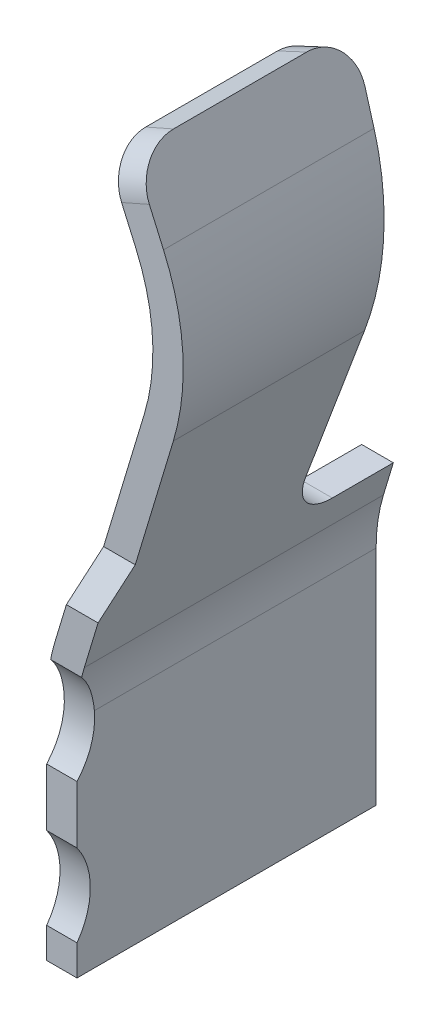
ISO-10303-21;
HEADER;
FILE_DESCRIPTION(('STEP AP214'),'2;1');
FILE_NAME('part.step','',(''),(''),'','','');
FILE_SCHEMA(('AUTOMOTIVE_DESIGN { 1 0 10303 214 1 1 1 1 }'));
ENDSEC;
DATA;
#1=APPLICATION_CONTEXT('core data for automotive mechanical design processes');
#2=APPLICATION_PROTOCOL_DEFINITION('international standard','automotive_design',2000,#1);
#3=PRODUCT_CONTEXT('',#1,'mechanical');
#4=PRODUCT('Part','Part','',(#3));
#5=PRODUCT_RELATED_PRODUCT_CATEGORY('part','',(#4));
#6=PRODUCT_DEFINITION_FORMATION('','',#4);
#7=PRODUCT_DEFINITION_CONTEXT('part definition',#1,'design');
#8=PRODUCT_DEFINITION('design','',#6,#7);
#9=PRODUCT_DEFINITION_SHAPE('','',#8);
#10=(LENGTH_UNIT() NAMED_UNIT(*) SI_UNIT(.MILLI.,.METRE.));
#11=(NAMED_UNIT(*) PLANE_ANGLE_UNIT() SI_UNIT($,.RADIAN.));
#12=(NAMED_UNIT(*) SI_UNIT($,.STERADIAN.) SOLID_ANGLE_UNIT());
#13=UNCERTAINTY_MEASURE_WITH_UNIT(LENGTH_MEASURE(1.E-05),#10,'distance_accuracy_value','');
#14=(GEOMETRIC_REPRESENTATION_CONTEXT(3) GLOBAL_UNCERTAINTY_ASSIGNED_CONTEXT((#13)) GLOBAL_UNIT_ASSIGNED_CONTEXT((#10,
#11,#12)) REPRESENTATION_CONTEXT('',''));
#15=CARTESIAN_POINT('',(0.,0.,0.));
#16=DIRECTION('',(0.,0.,1.));
#17=DIRECTION('',(1.,0.,0.));
#18=AXIS2_PLACEMENT_3D('',#15,#16,#17);
#19=CARTESIAN_POINT('',(0.683862741329986,3.53312166947706,-0.236832722369338));
#20=DIRECTION('',(-0.914255270392898,-0.402239697454473,0.0483789866630426));
#21=DIRECTION('',(0.402711251685503,-0.915327071470027,0.));
#22=AXIS2_PLACEMENT_3D('',#19,#20,#21);
#23=CYLINDRICAL_SURFACE('',#22,0.2);
#24=CARTESIAN_POINT('',(0.670358522674722,3.50329761180303,-0.434687053017797));
#25=CARTESIAN_POINT('',(0.619281595528135,3.6193909515076,-0.448650066039084));
#26=CARTESIAN_POINT('',(0.581012816481815,3.70637250294574,-0.363398989614743));
#27=CARTESIAN_POINT('',(0.581012816481815,3.70637250294574,-0.235652283248446));
#28=(BOUNDED_CURVE() B_SPLINE_CURVE(3,(#24,#25,#26,#27),.UNSPECIFIED.,.F.,
.F.) B_SPLINE_CURVE_WITH_KNOTS((4,4),(3.0320715031167,4.71238898038462),
.UNSPECIFIED.) CURVE() GEOMETRIC_REPRESENTATION_ITEM() RATIONAL_B_SPLINE_CURVE((1.,
0.778229742533871,0.778229742533871,1.)) REPRESENTATION_ITEM(''));
#29=CARTESIAN_POINT('',(0.670358522674722,3.50329761180303,-0.434687053017797));
#30=VERTEX_POINT('',#29);
#31=CARTESIAN_POINT('',(0.581012816481815,3.70637250294574,-0.235652283248446));
#32=VERTEX_POINT('',#31);
#33=EDGE_CURVE('E364',#30,#32,#28,.T.);
#34=ORIENTED_EDGE('',*,*,#33,.F.);
#35=DIRECTION('',(0.914255270392898,0.402239697454473,-0.0483789866630426));
#36=VECTOR('',#35,1.);
#37=CARTESIAN_POINT('',(-23.377177596038,-7.07676024092296,0.837819069551529));
#38=LINE('',#37,#36);
#39=CARTESIAN_POINT('',(0.533059461954222,3.44289092405021,-0.427421697659669));
#40=VERTEX_POINT('',#39);
#41=EDGE_CURVE('E11',#40,#30,#38,.T.);
#42=ORIENTED_EDGE('',*,*,#41,.F.);
#43=CARTESIAN_POINT('',(0.443713755761313,3.64596581519291,-0.228386927890318));
#44=CARTESIAN_POINT('',(0.443713755761312,3.64596581519291,-0.356133634256615));
#45=CARTESIAN_POINT('',(0.481982534807633,3.55898426375477,-0.441384710680957));
#46=CARTESIAN_POINT('',(0.533059461954222,3.44289092405021,-0.427421697659669));
#47=(BOUNDED_CURVE() B_SPLINE_CURVE(3,(#43,#44,#45,#46),.UNSPECIFIED.,.F.,
.F.) B_SPLINE_CURVE_WITH_KNOTS((4,4),(1.57079632679495,3.25111380406287),
.UNSPECIFIED.) CURVE() GEOMETRIC_REPRESENTATION_ITEM() RATIONAL_B_SPLINE_CURVE((1.,
0.77822974253387,0.77822974253387,1.)) REPRESENTATION_ITEM(''));
#48=CARTESIAN_POINT('',(0.443713755761313,3.64596581519291,-0.228386927890318));
#49=VERTEX_POINT('',#48);
#50=EDGE_CURVE('E559',#49,#40,#47,.T.);
#51=ORIENTED_EDGE('',*,*,#50,.F.);
#52=DIRECTION('',(-0.914255270392898,-0.402239697454473,0.0483789866630426));
#53=VECTOR('',#52,1.);
#54=CARTESIAN_POINT('',(0.603320490992884,3.71618708377106,-0.236832722369339));
#55=LINE('',#54,#53);
#56=EDGE_CURVE('E541',#32,#49,#55,.T.);
#57=ORIENTED_EDGE('',*,*,#56,.F.);
#58=EDGE_LOOP('',(#34,#42,#51,#57));
#59=FACE_BOUND('',#58,.T.);
#60=ADVANCED_FACE('F16',(#59),#23,.T.);
#61=CARTESIAN_POINT('',(0.661555066818914,3.52330708865174,0.423604352914838));
#62=DIRECTION('',(0.915327071470027,0.402711251685503,0.));
#63=DIRECTION('',(-0.402711251685503,0.915327071470027,0.));
#64=AXIS2_PLACEMENT_3D('',#61,#62,#63);
#65=CYLINDRICAL_SURFACE('',#64,0.2);
#66=CARTESIAN_POINT('',(0.524256006098412,3.46290040089891,0.423604352914837));
#67=DIRECTION('',(-0.915327071470028,-0.402711251685501,0.));
#68=DIRECTION('',(-0.402711251685501,0.915327071470028,0.));
#69=AXIS2_PLACEMENT_3D('',#66,#67,#68);
#70=CIRCLE('',#69,0.2);
#71=CARTESIAN_POINT('',(0.524256006098411,3.46290040089891,0.623604352914837));
#72=VERTEX_POINT('',#71);
#73=CARTESIAN_POINT('',(0.443713755761312,3.64596581519291,0.423604352914837));
#74=VERTEX_POINT('',#73);
#75=EDGE_CURVE('E556',#72,#74,#70,.T.);
#76=ORIENTED_EDGE('',*,*,#75,.F.);
#77=DIRECTION('',(-0.915327071470027,-0.402711251685503,0.));
#78=VECTOR('',#77,1.);
#79=CARTESIAN_POINT('',(-24.0930633966531,-7.36784176638169,0.623604352914803));
#80=LINE('',#79,#78);
#81=CARTESIAN_POINT('',(0.661555066818913,3.52330708865174,0.623604352914837));
#82=VERTEX_POINT('',#81);
#83=EDGE_CURVE('E27',#82,#72,#80,.T.);
#84=ORIENTED_EDGE('',*,*,#83,.F.);
#85=CARTESIAN_POINT('',(0.661555066818913,3.52330708865174,0.423604352914838));
#86=DIRECTION('',(0.915327071470028,0.4027112516855,0.));
#87=DIRECTION('',(0.4027112516855,-0.915327071470028,0.));
#88=AXIS2_PLACEMENT_3D('',#85,#86,#87);
#89=CIRCLE('',#88,0.2);
#90=CARTESIAN_POINT('',(0.581012816481813,3.70637250294574,0.423604352914837));
#91=VERTEX_POINT('',#90);
#92=EDGE_CURVE('E349',#91,#82,#89,.T.);
#93=ORIENTED_EDGE('',*,*,#92,.F.);
#94=DIRECTION('',(0.915327071470027,0.402711251685503,0.));
#95=VECTOR('',#94,1.);
#96=CARTESIAN_POINT('',(0.581012816481813,3.70637250294574,0.423604352914837));
#97=LINE('',#96,#95);
#98=EDGE_CURVE('E363',#74,#91,#97,.T.);
#99=ORIENTED_EDGE('',*,*,#98,.F.);
#100=EDGE_LOOP('',(#76,#84,#93,#99));
#101=FACE_BOUND('',#100,.T.);
#102=ADVANCED_FACE('F419',(#101),#65,.T.);
#103=CARTESIAN_POINT('',(-28.19,1.65634067151207,-0.212546111318104));
#104=DIRECTION('',(0.,-1.,0.));
#105=DIRECTION('',(0.,0.,-1.));
#106=AXIS2_PLACEMENT_3D('',#103,#104,#105);
#107=PLANE('',#106);
#108=DIRECTION('',(0.,0.,-1.));
#109=VECTOR('',#108,1.);
#110=CARTESIAN_POINT('',(0.34849659089442,1.65634067151207,-0.740000000000021));
#111=LINE('',#110,#109);
#112=CARTESIAN_POINT('',(0.34849659089442,1.65634067151207,-0.438042305987955));
#113=VERTEX_POINT('',#112);
#114=CARTESIAN_POINT('',(0.34849659089442,1.65634067151207,-0.740000000000021));
#115=VERTEX_POINT('',#114);
#116=EDGE_CURVE('E268',#113,#115,#111,.T.);
#117=ORIENTED_EDGE('',*,*,#116,.F.);
#118=DIRECTION('',(1.,0.,0.));
#119=VECTOR('',#118,1.);
#120=CARTESIAN_POINT('',(0.505164921058449,1.65634067151207,-0.438042305987954));
#121=LINE('',#120,#119);
#122=CARTESIAN_POINT('',(0.505164921058459,1.65634067151207,-0.438042305987954));
#123=VERTEX_POINT('',#122);
#124=EDGE_CURVE('E308',#113,#123,#121,.T.);
#125=ORIENTED_EDGE('',*,*,#124,.T.);
#126=DIRECTION('',(0.,0.,1.));
#127=VECTOR('',#126,1.);
#128=CARTESIAN_POINT('',(0.505164921058459,1.65634067151207,-0.74000000000002));
#129=LINE('',#128,#127);
#130=CARTESIAN_POINT('',(0.505164921058459,1.65634067151207,-0.74000000000002));
#131=VERTEX_POINT('',#130);
#132=EDGE_CURVE('E270',#131,#123,#129,.T.);
#133=ORIENTED_EDGE('',*,*,#132,.F.);
#134=DIRECTION('',(-1.,0.,0.));
#135=VECTOR('',#134,1.);
#136=CARTESIAN_POINT('',(1.27,1.65634067151207,-0.740000000000019));
#137=LINE('',#136,#135);
#138=EDGE_CURVE('E263',#131,#115,#137,.T.);
#139=ORIENTED_EDGE('',*,*,#138,.T.);
#140=EDGE_LOOP('',(#117,#125,#133,#139));
#141=FACE_BOUND('',#140,.T.);
#142=ADVANCED_FACE('F265',(#141),#107,.F.);
#143=CARTESIAN_POINT('',(-28.19,3.70637250294571,-0.459111687165995));
#144=DIRECTION('',(0.,0.119413416546905,0.992844618230162));
#145=DIRECTION('',(1.,0.,0.));
#146=AXIS2_PLACEMENT_3D('',#143,#144,#145);
#147=PLANE('',#146);
#148=DIRECTION('',(0.286748539926818,0.951150986717315,-0.11439875574724));
#149=VECTOR('',#148,1.);
#150=CARTESIAN_POINT('',(0.474122364888059,1.55337185451571,-0.200161637444148));
#151=LINE('',#150,#149);
#152=CARTESIAN_POINT('',(0.57266002273041,1.88022335482146,-0.239473382341922));
#153=VERTEX_POINT('',#152);
#154=CARTESIAN_POINT('',(0.780201760453783,2.56864369924933,-0.322272466749581));
#155=VERTEX_POINT('',#154);
#156=EDGE_CURVE('E547',#153,#155,#151,.T.);
#157=ORIENTED_EDGE('',*,*,#156,.F.);
#158=DIRECTION('',(-1.,0.,0.));
#159=VECTOR('',#158,1.);
#160=CARTESIAN_POINT('',(0.348496590894408,1.88022335482146,-0.239473382341922));
#161=LINE('',#160,#159);
#162=CARTESIAN_POINT('',(0.415991692566373,1.88022335482146,-0.239473382341922));
#163=VERTEX_POINT('',#162);
#164=EDGE_CURVE('E322',#153,#163,#161,.T.);
#165=ORIENTED_EDGE('',*,*,#164,.T.);
#166=DIRECTION('',(-0.28674853992682,-0.951150986717314,0.11439875574724));
#167=VECTOR('',#166,1.);
#168=CARTESIAN_POINT('',(0.330336045111495,1.59610175610151,-0.205300934614505));
#169=LINE('',#168,#167);
#170=CARTESIAN_POINT('',(0.63658626409634,2.61194022573825,-0.327479914176623));
#171=VERTEX_POINT('',#170);
#172=EDGE_CURVE('E289',#171,#163,#169,.T.);
#173=ORIENTED_EDGE('',*,*,#172,.F.);
#174=CARTESIAN_POINT('',(0.594476693183414,3.30329498734983,-0.410631932744419));
#175=CARTESIAN_POINT('',(0.691454989707599,3.08287189317973,-0.384120760424612));
#176=CARTESIAN_POINT('',(0.706095511176566,2.84250387207174,-0.355210731501567));
#177=CARTESIAN_POINT('',(0.63658626409634,2.61194022573825,-0.327479914176623));
#178=(BOUNDED_CURVE() B_SPLINE_CURVE(3,(#174,#175,#176,#177),.UNSPECIFIED.,.F.,
.F.) B_SPLINE_CURVE_WITH_KNOTS((4,4),(4.29791199977039,5.00519872138853),
.UNSPECIFIED.) CURVE() GEOMETRIC_REPRESENTATION_ITEM() RATIONAL_B_SPLINE_CURVE((1.,
0.958744787021091,0.958744787021091,1.)) REPRESENTATION_ITEM(''));
#179=CARTESIAN_POINT('',(0.594476693183414,3.30329498734983,-0.410631932744419));
#180=VERTEX_POINT('',#179);
#181=EDGE_CURVE('E568',#180,#171,#178,.T.);
#182=ORIENTED_EDGE('',*,*,#181,.F.);
#183=DIRECTION('',(0.400292818236851,-0.909830186054405,0.109428936813833));
#184=VECTOR('',#183,1.);
#185=CARTESIAN_POINT('',(0.580049180344067,3.33608744850051,-0.414576013974334));
#186=LINE('',#185,#184);
#187=EDGE_CURVE('E560',#40,#180,#186,.T.);
#188=ORIENTED_EDGE('',*,*,#187,.F.);
#189=ORIENTED_EDGE('',*,*,#41,.T.);
#190=DIRECTION('',(-0.40029281823685,0.909830186054405,-0.109428936813833));
#191=VECTOR('',#190,1.);
#192=CARTESIAN_POINT('',(0.717666489911778,3.39577078475993,-0.421754368938235));
#193=LINE('',#192,#191);
#194=CARTESIAN_POINT('',(0.731775753903915,3.36370167510267,-0.417897288102547));
#195=VERTEX_POINT('',#194);
#196=EDGE_CURVE('E571',#195,#30,#193,.T.);
#197=ORIENTED_EDGE('',*,*,#196,.F.);
#198=CARTESIAN_POINT('',(0.780201760453783,2.56864369924933,-0.322272466749581));
#199=CARTESIAN_POINT('',(0.860137394596042,2.83379189253285,-0.354162906673267));
#200=CARTESIAN_POINT('',(0.843300794906728,3.11021511680704,-0.387409439934769));
#201=CARTESIAN_POINT('',(0.731775753903915,3.36370167510267,-0.417897288102547));
#202=(BOUNDED_CURVE() B_SPLINE_CURVE(3,(#198,#199,#200,#201),.UNSPECIFIED.,.F.,
.F.) B_SPLINE_CURVE_WITH_KNOTS((4,4),(1.27798658579106,1.98527330740919),
.UNSPECIFIED.) CURVE() GEOMETRIC_REPRESENTATION_ITEM() RATIONAL_B_SPLINE_CURVE((1.,
0.958744787021091,0.958744787021091,1.)) REPRESENTATION_ITEM(''));
#203=EDGE_CURVE('E339',#155,#195,#202,.T.);
#204=ORIENTED_EDGE('',*,*,#203,.F.);
#205=EDGE_LOOP('',(#157,#165,#173,#182,#188,#189,#197,#204));
#206=FACE_BOUND('',#205,.T.);
#207=ADVANCED_FACE('F18',(#206),#147,.F.);
#208=CARTESIAN_POINT('',(-28.19,1.94413292378283,0.623604352914797));
#209=DIRECTION('',(0.,0.,-1.));
#210=DIRECTION('',(0.,-1.,0.));
#211=AXIS2_PLACEMENT_3D('',#208,#209,#210);
#212=PLANE('',#211);
#213=DIRECTION('',(0.4027112516855,-0.915327071470028,0.));
#214=VECTOR('',#213,1.);
#215=CARTESIAN_POINT('',(0.731775753903915,3.36370167510267,0.623604352914838));
#216=LINE('',#215,#214);
#217=CARTESIAN_POINT('',(0.731775753903915,3.36370167510267,0.623604352914838));
#218=VERTEX_POINT('',#217);
#219=EDGE_CURVE('E551',#82,#218,#216,.T.);
#220=ORIENTED_EDGE('',*,*,#219,.F.);
#221=ORIENTED_EDGE('',*,*,#83,.T.);
#222=DIRECTION('',(-0.402711251685501,0.915327071470028,0.));
#223=VECTOR('',#222,1.);
#224=CARTESIAN_POINT('',(0.594476693183414,3.30329498734984,0.623604352914837));
#225=LINE('',#224,#223);
#226=CARTESIAN_POINT('',(0.594476693183412,3.30329498734983,0.623604352914837));
#227=VERTEX_POINT('',#226);
#228=EDGE_CURVE('E555',#227,#72,#225,.T.);
#229=ORIENTED_EDGE('',*,*,#228,.F.);
#230=CARTESIAN_POINT('',(-0.320850378286616,2.90058373566433,0.623604352914836));
#231=DIRECTION('',(0.,0.,1.));
#232=DIRECTION('',(-1.,0.,0.));
#233=AXIS2_PLACEMENT_3D('',#230,#231,#232);
#234=CIRCLE('',#233,1.);
#235=CARTESIAN_POINT('',(0.636586264096339,2.61194022573825,0.623604352914837));
#236=VERTEX_POINT('',#235);
#237=EDGE_CURVE('E151',#236,#227,#234,.T.);
#238=ORIENTED_EDGE('',*,*,#237,.F.);
#239=DIRECTION('',(0.28864350992609,0.957436642382956,0.));
#240=VECTOR('',#239,1.);
#241=CARTESIAN_POINT('',(0.31256335761704,1.53714937485737,0.623604352914836));
#242=LINE('',#241,#240);
#243=CARTESIAN_POINT('',(0.435258849771637,1.94413292378283,0.623604352914837));
#244=VERTEX_POINT('',#243);
#245=EDGE_CURVE('E256',#244,#236,#242,.T.);
#246=ORIENTED_EDGE('',*,*,#245,.F.);
#247=DIRECTION('',(1.,0.,0.));
#248=VECTOR('',#247,1.);
#249=CARTESIAN_POINT('',(-28.19,1.94413292378283,0.623604352914797));
#250=LINE('',#249,#248);
#251=CARTESIAN_POINT('',(0.591927179935673,1.94413292378283,0.623604352914837));
#252=VERTEX_POINT('',#251);
#253=EDGE_CURVE('E273',#244,#252,#250,.T.);
#254=ORIENTED_EDGE('',*,*,#253,.T.);
#255=DIRECTION('',(-0.288643509926088,-0.957436642382956,0.));
#256=VECTOR('',#255,1.);
#257=CARTESIAN_POINT('',(0.456178853974485,1.49385284836845,0.623604352914837));
#258=LINE('',#257,#256);
#259=CARTESIAN_POINT('',(0.780201760453781,2.56864369924933,0.623604352914837));
#260=VERTEX_POINT('',#259);
#261=EDGE_CURVE('E546',#260,#252,#258,.T.);
#262=ORIENTED_EDGE('',*,*,#261,.F.);
#263=CARTESIAN_POINT('',(-0.320850378286616,2.90058373566433,0.623604352914836));
#264=DIRECTION('',(0.,0.,-1.));
#265=DIRECTION('',(-1.,0.,0.));
#266=AXIS2_PLACEMENT_3D('',#263,#264,#265);
#267=CIRCLE('',#266,1.15);
#268=EDGE_CURVE('E338',#218,#260,#267,.T.);
#269=ORIENTED_EDGE('',*,*,#268,.F.);
#270=EDGE_LOOP('',(#220,#221,#229,#238,#246,#254,#262,#269));
#271=FACE_BOUND('',#270,.T.);
#272=ADVANCED_FACE('F410',(#271),#212,.F.);
#273=CARTESIAN_POINT('',(-28.19,1.7003498353216,0.749999999999972));
#274=DIRECTION('',(0.,-0.460287319631494,-0.887770005906065));
#275=DIRECTION('',(0.,-0.887770005906065,0.460287319631494));
#276=AXIS2_PLACEMENT_3D('',#273,#274,#275);
#277=PLANE('',#276);
#278=ORIENTED_EDGE('',*,*,#253,.F.);
#279=DIRECTION('',(0.258541028225373,0.857586072334425,-0.444637678635293));
#280=VECTOR('',#279,1.);
#281=CARTESIAN_POINT('',(0.493576561693564,2.13757401070795,0.523309818502746));
#282=LINE('',#281,#280);
#283=CARTESIAN_POINT('',(0.367578912320737,1.7196371362757,0.73999999999998));
#284=VERTEX_POINT('',#283);
#285=EDGE_CURVE('E301',#284,#244,#282,.T.);
#286=ORIENTED_EDGE('',*,*,#285,.F.);
#287=DIRECTION('',(-1.,0.,0.));
#288=VECTOR('',#287,1.);
#289=CARTESIAN_POINT('',(1.27,1.7196371362757,0.739999999999981));
#290=LINE('',#289,#288);
#291=CARTESIAN_POINT('',(0.524247242484774,1.7196371362757,0.73999999999998));
#292=VERTEX_POINT('',#291);
#293=EDGE_CURVE('E333',#292,#284,#290,.T.);
#294=ORIENTED_EDGE('',*,*,#293,.F.);
#295=DIRECTION('',(-0.258541028225372,-0.857586072334425,0.444637678635293));
#296=VECTOR('',#295,1.);
#297=CARTESIAN_POINT('',(0.639772638083794,2.10283732290249,0.541319952677682));
#298=LINE('',#297,#296);
#299=EDGE_CURVE('E591',#252,#292,#298,.T.);
#300=ORIENTED_EDGE('',*,*,#299,.F.);
#301=EDGE_LOOP('',(#278,#286,#294,#300));
#302=FACE_BOUND('',#301,.T.);
#303=ADVANCED_FACE('F406',(#302),#277,.F.);
#304=CARTESIAN_POINT('',(1.27,1.24850586493128,0.739999999999981));
#305=DIRECTION('',(0.,0.,-1.));
#306=DIRECTION('',(0.,-1.,0.));
#307=AXIS2_PLACEMENT_3D('',#304,#305,#306);
#308=PLANE('',#307);
#309=DIRECTION('',(0.,1.,0.));
#310=VECTOR('',#309,1.);
#311=CARTESIAN_POINT('',(0.42,0.145965815192914,0.73999999999998));
#312=LINE('',#311,#310);
#313=CARTESIAN_POINT('',(0.42,0.145965815192914,0.73999999999998));
#314=VERTEX_POINT('',#313);
#315=CARTESIAN_POINT('',(0.41999999999999,0.296740599868486,0.73999999999998));
#316=VERTEX_POINT('',#315);
#317=EDGE_CURVE('E318',#314,#316,#312,.T.);
#318=ORIENTED_EDGE('',*,*,#317,.T.);
#319=DIRECTION('',(-1.,0.,0.));
#320=VECTOR('',#319,1.);
#321=CARTESIAN_POINT('',(-28.19,0.296740599868486,0.73999999999994));
#322=LINE('',#321,#320);
#323=CARTESIAN_POINT('',(0.27,0.296740599868486,0.739999999999979));
#324=VERTEX_POINT('',#323);
#325=EDGE_CURVE('E317',#316,#324,#322,.T.);
#326=ORIENTED_EDGE('',*,*,#325,.T.);
#327=DIRECTION('',(0.,-1.,0.));
#328=VECTOR('',#327,1.);
#329=CARTESIAN_POINT('',(0.27,0.145965815192914,0.739999999999979));
#330=LINE('',#329,#328);
#331=CARTESIAN_POINT('',(0.27,0.145965815192914,0.739999999999979));
#332=VERTEX_POINT('',#331);
#333=EDGE_CURVE('E274',#324,#332,#330,.T.);
#334=ORIENTED_EDGE('',*,*,#333,.T.);
#335=DIRECTION('',(1.,0.,0.));
#336=VECTOR('',#335,1.);
#337=CARTESIAN_POINT('',(0.42,0.145965815192914,0.73999999999998));
#338=LINE('',#337,#336);
#339=EDGE_CURVE('E343',#332,#314,#338,.T.);
#340=ORIENTED_EDGE('',*,*,#339,.T.);
#341=EDGE_LOOP('',(#318,#326,#334,#340));
#342=FACE_BOUND('',#341,.T.);
#343=ADVANCED_FACE('F409',(#342),#308,.F.);
#344=CARTESIAN_POINT('',(1.27,1.24850586493128,-0.740000000000019));
#345=DIRECTION('',(0.,0.,-1.));
#346=DIRECTION('',(0.,-1.,0.));
#347=AXIS2_PLACEMENT_3D('',#344,#345,#346);
#348=PLANE('',#347);
#349=ORIENTED_EDGE('',*,*,#138,.F.);
#350=DIRECTION('',(0.288643509926088,0.957436642382956,0.));
#351=VECTOR('',#350,1.);
#352=CARTESIAN_POINT('',(0.456178853974486,1.49385284836845,-0.74000000000002));
#353=LINE('',#352,#351);
#354=CARTESIAN_POINT('',(0.456178853974486,1.49385284836845,-0.74000000000002));
#355=VERTEX_POINT('',#354);
#356=EDGE_CURVE('E600',#355,#131,#353,.T.);
#357=ORIENTED_EDGE('',*,*,#356,.F.);
#358=CARTESIAN_POINT('',(1.27,1.24850586493128,-0.740000000000019));
#359=DIRECTION('',(0.,0.,-1.));
#360=DIRECTION('',(1.,0.,0.));
#361=AXIS2_PLACEMENT_3D('',#358,#359,#360);
#362=CIRCLE('',#361,0.85);
#363=CARTESIAN_POINT('',(0.42,1.24850586493128,-0.74000000000002));
#364=VERTEX_POINT('',#363);
#365=EDGE_CURVE('E644',#364,#355,#362,.T.);
#366=ORIENTED_EDGE('',*,*,#365,.F.);
#367=DIRECTION('',(0.,1.,0.));
#368=VECTOR('',#367,1.);
#369=CARTESIAN_POINT('',(0.42,0.145965815192914,-0.74000000000002));
#370=LINE('',#369,#368);
#371=CARTESIAN_POINT('',(0.42,0.145965815192914,-0.74000000000002));
#372=VERTEX_POINT('',#371);
#373=EDGE_CURVE('E321',#372,#364,#370,.T.);
#374=ORIENTED_EDGE('',*,*,#373,.F.);
#375=DIRECTION('',(1.,0.,0.));
#376=VECTOR('',#375,1.);
#377=CARTESIAN_POINT('',(0.42,0.145965815192914,-0.74000000000002));
#378=LINE('',#377,#376);
#379=CARTESIAN_POINT('',(0.27,0.145965815192914,-0.740000000000021));
#380=VERTEX_POINT('',#379);
#381=EDGE_CURVE('E522',#380,#372,#378,.T.);
#382=ORIENTED_EDGE('',*,*,#381,.F.);
#383=DIRECTION('',(0.,-1.,0.));
#384=VECTOR('',#383,1.);
#385=CARTESIAN_POINT('',(0.27,0.145965815192914,-0.740000000000021));
#386=LINE('',#385,#384);
#387=CARTESIAN_POINT('',(0.27,1.24850586493128,-0.740000000000021));
#388=VERTEX_POINT('',#387);
#389=EDGE_CURVE('E42',#388,#380,#386,.T.);
#390=ORIENTED_EDGE('',*,*,#389,.F.);
#391=CARTESIAN_POINT('',(1.27,1.24850586493128,-0.740000000000019));
#392=DIRECTION('',(0.,0.,1.));
#393=DIRECTION('',(1.,0.,0.));
#394=AXIS2_PLACEMENT_3D('',#391,#392,#393);
#395=CIRCLE('',#394,1.);
#396=CARTESIAN_POINT('',(0.312563357617044,1.53714937485737,-0.740000000000021));
#397=VERTEX_POINT('',#396);
#398=EDGE_CURVE('E279',#397,#388,#395,.T.);
#399=ORIENTED_EDGE('',*,*,#398,.F.);
#400=DIRECTION('',(-0.28864350992609,-0.957436642382956,0.));
#401=VECTOR('',#400,1.);
#402=CARTESIAN_POINT('',(0.312563357617042,1.53714937485737,-0.740000000000021));
#403=LINE('',#402,#401);
#404=EDGE_CURVE('E277',#115,#397,#403,.T.);
#405=ORIENTED_EDGE('',*,*,#404,.F.);
#406=EDGE_LOOP('',(#349,#357,#366,#374,#382,#390,#399,#405));
#407=FACE_BOUND('',#406,.T.);
#408=ADVANCED_FACE('F278',(#407),#348,.T.);
#409=CARTESIAN_POINT('',(0.27,0.145965815192914,-0.740000000000021));
#410=DIRECTION('',(1.,0.,0.));
#411=DIRECTION('',(0.,1.,0.));
#412=AXIS2_PLACEMENT_3D('',#409,#410,#411);
#413=PLANE('',#412);
#414=DIRECTION('',(0.,-1.,0.));
#415=VECTOR('',#414,1.);
#416=CARTESIAN_POINT('',(0.27,0.145965815192914,0.739999999999979));
#417=LINE('',#416,#415);
#418=CARTESIAN_POINT('',(0.27,0.988055123608201,0.739999999999979));
#419=VERTEX_POINT('',#418);
#420=CARTESIAN_POINT('',(0.269999999999996,0.703259400131467,0.739999999999979));
#421=VERTEX_POINT('',#420);
#422=EDGE_CURVE('E340',#419,#421,#417,.T.);
#423=ORIENTED_EDGE('',*,*,#422,.F.);
#424=CARTESIAN_POINT('',(0.269999999999996,1.21669179396546,0.995153761033096));
#425=DIRECTION('',(1.,0.,0.));
#426=DIRECTION('',(0.,1.,0.));
#427=AXIS2_PLACEMENT_3D('',#424,#425,#426);
#428=CIRCLE('',#427,0.342604974863759);
#429=CARTESIAN_POINT('',(0.269999999999996,1.24850586493128,0.654029100989324));
#430=VERTEX_POINT('',#429);
#431=EDGE_CURVE('E326',#419,#430,#428,.T.);
#432=ORIENTED_EDGE('',*,*,#431,.T.);
#433=DIRECTION('',(0.,0.,1.));
#434=VECTOR('',#433,1.);
#435=CARTESIAN_POINT('',(0.27,1.24850586493128,-0.740000000000021));
#436=LINE('',#435,#434);
#437=EDGE_CURVE('E305',#388,#430,#436,.T.);
#438=ORIENTED_EDGE('',*,*,#437,.F.);
#439=ORIENTED_EDGE('',*,*,#389,.T.);
#440=DIRECTION('',(0.,0.,1.));
#441=VECTOR('',#440,1.);
#442=CARTESIAN_POINT('',(0.27,0.145965815192914,-0.740000000000021));
#443=LINE('',#442,#441);
#444=EDGE_CURVE('E533',#380,#332,#443,.T.);
#445=ORIENTED_EDGE('',*,*,#444,.T.);
#446=ORIENTED_EDGE('',*,*,#333,.F.);
#447=CARTESIAN_POINT('',(0.269999999999996,0.499999999999977,1.0194268345702));
#448=DIRECTION('',(1.,0.,0.));
#449=DIRECTION('',(0.,1.,0.));
#450=AXIS2_PLACEMENT_3D('',#447,#448,#449);
#451=CIRCLE('',#450,0.345533991988848);
#452=EDGE_CURVE('E494',#324,#421,#451,.T.);
#453=ORIENTED_EDGE('',*,*,#452,.T.);
#454=EDGE_LOOP('',(#423,#432,#438,#439,#445,#446,#453));
#455=FACE_BOUND('',#454,.T.);
#456=ADVANCED_FACE('F387',(#455),#413,.F.);
#457=CARTESIAN_POINT('',(1.27,1.24850586493128,-0.740000000000019));
#458=DIRECTION('',(0.,0.,1.));
#459=DIRECTION('',(-1.,0.,0.));
#460=AXIS2_PLACEMENT_3D('',#457,#458,#459);
#461=CYLINDRICAL_SURFACE('',#460,1.);
#462=ORIENTED_EDGE('',*,*,#437,.T.);
#463=CARTESIAN_POINT('',(0.269999999999998,1.24850586493127,0.654029100989324));
#464=CARTESIAN_POINT('',(0.269999925926372,1.25306932177748,0.654454497923835));
#465=CARTESIAN_POINT('',(0.270031235278632,1.25762446546712,0.654969794425774));
#466=CARTESIAN_POINT('',(0.27015516509568,1.26669234380872,0.656178662703507));
#467=CARTESIAN_POINT('',(0.270247549202971,1.27120517419842,0.656871540938563));
#468=CARTESIAN_POINT('',(0.270491913293221,1.28018764830056,0.658435530000101));
#469=CARTESIAN_POINT('',(0.270643757103872,1.28465736694881,0.659306231418194));
#470=CARTESIAN_POINT('',(0.271005222968956,1.29355289226453,0.661225514697385));
#471=CARTESIAN_POINT('',(0.271214805540905,1.29797872680563,0.66227397481712));
#472=CARTESIAN_POINT('',(0.271689972072932,1.30678583476397,0.664548502475786));
#473=CARTESIAN_POINT('',(0.271955607473969,1.31116706334694,0.665774732832754));
#474=CARTESIAN_POINT('',(0.272541108471185,1.31988437499395,0.668404514864849));
#475=CARTESIAN_POINT('',(0.272861109005426,1.32422031651338,0.669808505488944));
#476=CARTESIAN_POINT('',(0.273553589303768,1.33284654509273,0.672793524574298));
#477=CARTESIAN_POINT('',(0.273926278626932,1.33713657245114,0.67437525453736));
#478=CARTESIAN_POINT('',(0.274722397581461,1.34567049059148,0.677715533217567));
#479=CARTESIAN_POINT('',(0.275146101326992,1.34991398511754,0.679475028174295));
#480=CARTESIAN_POINT('',(0.276036781506109,1.35830019523904,0.683146652073494));
#481=CARTESIAN_POINT('',(0.276503492804421,1.36244335249443,0.685057836907499));
#482=CARTESIAN_POINT('',(0.277476871397987,1.37063194178074,0.6890335315101));
#483=CARTESIAN_POINT('',(0.277983387883378,1.3746776733665,0.691097460992356));
#484=CARTESIAN_POINT('',(0.279032868317638,1.38267128376232,0.695378434355305));
#485=CARTESIAN_POINT('',(0.279575752647371,1.3866193519919,0.69759514404689));
#486=CARTESIAN_POINT('',(0.280694557017771,1.39441764648526,0.702181418874191));
#487=CARTESIAN_POINT('',(0.281270457005611,1.39826793013232,0.704550891332612));
#488=CARTESIAN_POINT('',(0.28245197037195,1.40587073759695,0.709442454924467));
#489=CARTESIAN_POINT('',(0.283057610817165,1.40962316741917,0.711964685588729));
#490=CARTESIAN_POINT('',(0.284295379263649,1.4170304504751,0.717161525963165));
#491=CARTESIAN_POINT('',(0.284927568526994,1.42068504210779,0.719836493879691));
#492=CARTESIAN_POINT('',(0.286215293457786,1.42789683764576,0.725338623347788));
#493=CARTESIAN_POINT('',(0.286870911529251,1.43145359950846,0.728166344681211));
#494=CARTESIAN_POINT('',(0.28820248405423,1.43847023752972,0.733973670299352));
#495=CARTESIAN_POINT('',(0.288878529499035,1.44192948379825,0.736954014976151));
#496=CARTESIAN_POINT('',(0.289560881865272,1.44532846432271,0.73999999999998));
#497=B_SPLINE_CURVE_WITH_KNOTS('',3,(#463,#464,#465,#466,#467,#468,#469,#470,#471,#472,#473,
#474,#475,#476,#477,#478,#479,#480,#481,#482,#483,#484,#485,#486,#487,#488,#489,#490,#491,#492,
#493,#494,#495,#496),.UNSPECIFIED.,.F.,.F.,(4,2,2,2,2,2,2,2,2,2,2,2,2,2,2,2,4),(0.,
0.013748827736232,0.0274447569667543,0.0411095020469267,0.0547649260984996,0.0684329369744623,
0.0821353821572885,0.0958939450956067,0.109730045405059,0.123485924962941,0.137191991355335,
0.150868974599205,0.164537737053089,0.17821917870054,0.191934141578145,0.205703315519925,
0.219547147320743),.UNSPECIFIED.);
#498=CARTESIAN_POINT('',(0.289560881865272,1.44532846432271,0.739999999999979));
#499=VERTEX_POINT('',#498);
#500=EDGE_CURVE('E370',#430,#499,#497,.T.);
#501=ORIENTED_EDGE('',*,*,#500,.T.);
#502=CARTESIAN_POINT('',(1.27,1.24850586493128,0.739999999999981));
#503=DIRECTION('',(0.,0.,1.));
#504=DIRECTION('',(1.,0.,0.));
#505=AXIS2_PLACEMENT_3D('',#502,#503,#504);
#506=CIRCLE('',#505,1.);
#507=CARTESIAN_POINT('',(0.312563357617042,1.53714937485737,0.739999999999979));
#508=VERTEX_POINT('',#507);
#509=EDGE_CURVE('E332',#508,#499,#506,.T.);
#510=ORIENTED_EDGE('',*,*,#509,.F.);
#511=DIRECTION('',(0.,0.,1.));
#512=VECTOR('',#511,1.);
#513=CARTESIAN_POINT('',(0.312563357617044,1.53714937485737,-0.740000000000021));
#514=LINE('',#513,#512);
#515=EDGE_CURVE('E282',#397,#508,#514,.T.);
#516=ORIENTED_EDGE('',*,*,#515,.F.);
#517=ORIENTED_EDGE('',*,*,#398,.T.);
#518=EDGE_LOOP('',(#462,#501,#510,#516,#517));
#519=FACE_BOUND('',#518,.T.);
#520=ADVANCED_FACE('F377',(#519),#461,.T.);
#521=CARTESIAN_POINT('',(0.312563357617042,1.53714937485737,-0.740000000000021));
#522=DIRECTION('',(0.957436642382956,-0.28864350992609,0.));
#523=DIRECTION('',(0.,0.,-1.));
#524=AXIS2_PLACEMENT_3D('',#521,#522,#523);
#525=PLANE('',#524);
#526=ORIENTED_EDGE('',*,*,#172,.T.);
#527=CARTESIAN_POINT('',(0.415991692566373,1.88022335482146,-0.239473382341922));
#528=CARTESIAN_POINT('',(0.413601725701353,1.87229578405696,-0.238519901512672));
#529=CARTESIAN_POINT('',(0.411198844415482,1.86432537588468,-0.238042305987954));
#530=CARTESIAN_POINT('',(0.408791653178165,1.85634067151208,-0.238042305987954));
#531=(BOUNDED_CURVE() B_SPLINE_CURVE(3,(#527,#528,#529,#530),.UNSPECIFIED.,.F.,
.F.) B_SPLINE_CURVE_WITH_KNOTS((4,4),(4.59268992994791,4.71238898038469),
.UNSPECIFIED.) CURVE() GEOMETRIC_REPRESENTATION_ITEM() RATIONAL_B_SPLINE_CURVE((1.,
0.998806367803328,0.998806367803328,1.)) REPRESENTATION_ITEM(''));
#532=CARTESIAN_POINT('',(0.408791653178165,1.85634067151208,-0.238042305987954));
#533=VERTEX_POINT('',#532);
#534=EDGE_CURVE('E327',#163,#533,#531,.T.);
#535=ORIENTED_EDGE('',*,*,#534,.T.);
#536=CARTESIAN_POINT('',(0.408791653178165,1.85634067151208,-0.238042305987954));
#537=CARTESIAN_POINT('',(0.373471623436478,1.73918338398669,-0.238042305987954));
#538=CARTESIAN_POINT('',(0.348496590894422,1.65634067151208,-0.320885018462573));
#539=CARTESIAN_POINT('',(0.34849659089442,1.65634067151207,-0.438042305987955));
#540=(BOUNDED_CURVE() B_SPLINE_CURVE(3,(#536,#537,#538,#539),.UNSPECIFIED.,.F.,
.F.) B_SPLINE_CURVE_WITH_KNOTS((4,4),(4.71238898038469,6.28318530717959),
.UNSPECIFIED.) CURVE() GEOMETRIC_REPRESENTATION_ITEM() RATIONAL_B_SPLINE_CURVE((1.,
0.804737854124365,0.804737854124365,1.)) REPRESENTATION_ITEM(''));
#541=EDGE_CURVE('E286',#533,#113,#540,.T.);
#542=ORIENTED_EDGE('',*,*,#541,.T.);
#543=ORIENTED_EDGE('',*,*,#116,.T.);
#544=ORIENTED_EDGE('',*,*,#404,.T.);
#545=ORIENTED_EDGE('',*,*,#515,.T.);
#546=DIRECTION('',(-0.28864350992609,-0.957436642382956,0.));
#547=VECTOR('',#546,1.);
#548=CARTESIAN_POINT('',(0.31256335761704,1.53714937485737,0.739999999999979));
#549=LINE('',#548,#547);
#550=EDGE_CURVE('E328',#284,#508,#549,.T.);
#551=ORIENTED_EDGE('',*,*,#550,.F.);
#552=ORIENTED_EDGE('',*,*,#285,.T.);
#553=ORIENTED_EDGE('',*,*,#245,.T.);
#554=DIRECTION('',(0.,0.,1.));
#555=VECTOR('',#554,1.);
#556=CARTESIAN_POINT('',(0.63658626409634,2.61194022573825,-0.74000000000002));
#557=LINE('',#556,#555);
#558=EDGE_CURVE('E354',#171,#236,#557,.T.);
#559=ORIENTED_EDGE('',*,*,#558,.F.);
#560=EDGE_LOOP('',(#526,#535,#542,#543,#544,#545,#551,#552,#553,#559));
#561=FACE_BOUND('',#560,.T.);
#562=ADVANCED_FACE('F284',(#561),#525,.F.);
#563=CARTESIAN_POINT('',(-0.320850378286615,2.90058373566433,-0.740000000000021));
#564=DIRECTION('',(0.,0.,1.));
#565=DIRECTION('',(-1.,0.,0.));
#566=AXIS2_PLACEMENT_3D('',#563,#564,#565);
#567=CYLINDRICAL_SURFACE('',#566,1.);
#568=DIRECTION('',(0.,0.,1.));
#569=VECTOR('',#568,1.);
#570=CARTESIAN_POINT('',(0.594476693183414,3.30329498734983,-0.74000000000002));
#571=LINE('',#570,#569);
#572=EDGE_CURVE('E299',#180,#227,#571,.T.);
#573=ORIENTED_EDGE('',*,*,#572,.F.);
#574=ORIENTED_EDGE('',*,*,#181,.T.);
#575=ORIENTED_EDGE('',*,*,#558,.T.);
#576=ORIENTED_EDGE('',*,*,#237,.T.);
#577=EDGE_LOOP('',(#573,#574,#575,#576));
#578=FACE_BOUND('',#577,.T.);
#579=ADVANCED_FACE('F414',(#578),#567,.F.);
#580=CARTESIAN_POINT('',(0.594476693183415,3.30329498734984,-0.74000000000002));
#581=DIRECTION('',(0.915327071470028,0.402711251685501,0.));
#582=DIRECTION('',(0.,0.,-1.));
#583=AXIS2_PLACEMENT_3D('',#580,#581,#582);
#584=PLANE('',#583);
#585=ORIENTED_EDGE('',*,*,#228,.T.);
#586=ORIENTED_EDGE('',*,*,#75,.T.);
#587=DIRECTION('',(0.,0.,1.));
#588=VECTOR('',#587,1.);
#589=CARTESIAN_POINT('',(0.443713755761313,3.64596581519291,-0.740000000000021));
#590=LINE('',#589,#588);
#591=EDGE_CURVE('E359',#49,#74,#590,.T.);
#592=ORIENTED_EDGE('',*,*,#591,.F.);
#593=ORIENTED_EDGE('',*,*,#50,.T.);
#594=ORIENTED_EDGE('',*,*,#187,.T.);
#595=ORIENTED_EDGE('',*,*,#572,.T.);
#596=EDGE_LOOP('',(#585,#586,#592,#593,#594,#595));
#597=FACE_BOUND('',#596,.T.);
#598=ADVANCED_FACE('F425',(#597),#584,.F.);
#599=CARTESIAN_POINT('',(0.581012816481815,3.70637250294574,-0.74000000000002));
#600=DIRECTION('',(0.402711251685503,-0.915327071470027,0.));
#601=DIRECTION('',(0.,0.,-1.));
#602=AXIS2_PLACEMENT_3D('',#599,#600,#601);
#603=PLANE('',#602);
#604=ORIENTED_EDGE('',*,*,#591,.T.);
#605=ORIENTED_EDGE('',*,*,#98,.T.);
#606=DIRECTION('',(0.,0.,1.));
#607=VECTOR('',#606,1.);
#608=CARTESIAN_POINT('',(0.581012816481815,3.70637250294574,-0.74000000000002));
#609=LINE('',#608,#607);
#610=EDGE_CURVE('E345',#32,#91,#609,.T.);
#611=ORIENTED_EDGE('',*,*,#610,.F.);
#612=ORIENTED_EDGE('',*,*,#56,.T.);
#613=EDGE_LOOP('',(#604,#605,#611,#612));
#614=FACE_BOUND('',#613,.T.);
#615=ADVANCED_FACE('F404',(#614),#603,.F.);
#616=CARTESIAN_POINT('',(0.731775753903917,3.36370167510267,-0.74000000000002));
#617=DIRECTION('',(-0.915327071470028,-0.4027112516855,0.));
#618=DIRECTION('',(-0.4027112516855,0.915327071470028,0.));
#619=AXIS2_PLACEMENT_3D('',#616,#617,#618);
#620=PLANE('',#619);
#621=ORIENTED_EDGE('',*,*,#610,.T.);
#622=ORIENTED_EDGE('',*,*,#92,.T.);
#623=ORIENTED_EDGE('',*,*,#219,.T.);
#624=DIRECTION('',(0.,0.,1.));
#625=VECTOR('',#624,1.);
#626=CARTESIAN_POINT('',(0.731775753903917,3.36370167510267,-0.74000000000002));
#627=LINE('',#626,#625);
#628=EDGE_CURVE('E334',#195,#218,#627,.T.);
#629=ORIENTED_EDGE('',*,*,#628,.F.);
#630=ORIENTED_EDGE('',*,*,#196,.T.);
#631=ORIENTED_EDGE('',*,*,#33,.T.);
#632=EDGE_LOOP('',(#621,#622,#623,#629,#630,#631));
#633=FACE_BOUND('',#632,.T.);
#634=ADVANCED_FACE('F401',(#633),#620,.F.);
#635=CARTESIAN_POINT('',(-0.320850378286615,2.90058373566433,-0.740000000000021));
#636=DIRECTION('',(0.,0.,1.));
#637=DIRECTION('',(-1.,0.,0.));
#638=AXIS2_PLACEMENT_3D('',#635,#636,#637);
#639=CYLINDRICAL_SURFACE('',#638,1.15);
#640=DIRECTION('',(0.,0.,1.));
#641=VECTOR('',#640,1.);
#642=CARTESIAN_POINT('',(0.780201760453783,2.56864369924933,-0.74000000000002));
#643=LINE('',#642,#641);
#644=EDGE_CURVE('E542',#155,#260,#643,.T.);
#645=ORIENTED_EDGE('',*,*,#644,.F.);
#646=ORIENTED_EDGE('',*,*,#203,.T.);
#647=ORIENTED_EDGE('',*,*,#628,.T.);
#648=ORIENTED_EDGE('',*,*,#268,.T.);
#649=EDGE_LOOP('',(#645,#646,#647,#648));
#650=FACE_BOUND('',#649,.T.);
#651=ADVANCED_FACE('F399',(#650),#639,.T.);
#652=CARTESIAN_POINT('',(0.456178853974486,1.49385284836845,-0.74000000000002));
#653=DIRECTION('',(-0.957436642382956,0.288643509926088,0.));
#654=DIRECTION('',(0.,0.,1.));
#655=AXIS2_PLACEMENT_3D('',#652,#653,#654);
#656=PLANE('',#655);
#657=ORIENTED_EDGE('',*,*,#356,.T.);
#658=ORIENTED_EDGE('',*,*,#132,.T.);
#659=CARTESIAN_POINT('',(0.505164921058459,1.65634067151207,-0.438042305987954));
#660=CARTESIAN_POINT('',(0.505164921058456,1.65634067151208,-0.320885018462573));
#661=CARTESIAN_POINT('',(0.530139953600512,1.73918338398669,-0.238042305987954));
#662=CARTESIAN_POINT('',(0.565459983342198,1.85634067151208,-0.238042305987954));
#663=(BOUNDED_CURVE() B_SPLINE_CURVE(3,(#659,#660,#661,#662),.UNSPECIFIED.,.F.,
.F.) B_SPLINE_CURVE_WITH_KNOTS((4,4),(0.,1.5707963267949),
.UNSPECIFIED.) CURVE() GEOMETRIC_REPRESENTATION_ITEM() RATIONAL_B_SPLINE_CURVE((1.,
0.804737854124365,0.804737854124365,1.)) REPRESENTATION_ITEM(''));
#664=CARTESIAN_POINT('',(0.565459983342198,1.85634067151208,-0.238042305987954));
#665=VERTEX_POINT('',#664);
#666=EDGE_CURVE('E311',#123,#665,#663,.T.);
#667=ORIENTED_EDGE('',*,*,#666,.T.);
#668=CARTESIAN_POINT('',(0.565459983342198,1.85634067151208,-0.238042305987954));
#669=CARTESIAN_POINT('',(0.567867174579515,1.86432537588468,-0.238042305987954));
#670=CARTESIAN_POINT('',(0.570270055865387,1.87229578405696,-0.238519901512672));
#671=CARTESIAN_POINT('',(0.57266002273041,1.88022335482146,-0.239473382341922));
#672=(BOUNDED_CURVE() B_SPLINE_CURVE(3,(#668,#669,#670,#671),.UNSPECIFIED.,.F.,
.F.) B_SPLINE_CURVE_WITH_KNOTS((4,4),(1.5707963267949,1.69049537723168),
.UNSPECIFIED.) CURVE() GEOMETRIC_REPRESENTATION_ITEM() RATIONAL_B_SPLINE_CURVE((1.,
0.998806367803328,0.998806367803328,1.)) REPRESENTATION_ITEM(''));
#673=EDGE_CURVE('E616',#665,#153,#672,.T.);
#674=ORIENTED_EDGE('',*,*,#673,.T.);
#675=ORIENTED_EDGE('',*,*,#156,.T.);
#676=ORIENTED_EDGE('',*,*,#644,.T.);
#677=ORIENTED_EDGE('',*,*,#261,.T.);
#678=ORIENTED_EDGE('',*,*,#299,.T.);
#679=DIRECTION('',(0.288643509926088,0.957436642382956,0.));
#680=VECTOR('',#679,1.);
#681=CARTESIAN_POINT('',(0.456178853974485,1.49385284836845,0.73999999999998));
#682=LINE('',#681,#680);
#683=CARTESIAN_POINT('',(0.456178853974485,1.49385284836845,0.73999999999998));
#684=VERTEX_POINT('',#683);
#685=EDGE_CURVE('E358',#684,#292,#682,.T.);
#686=ORIENTED_EDGE('',*,*,#685,.F.);
#687=DIRECTION('',(0.,0.,1.));
#688=VECTOR('',#687,1.);
#689=CARTESIAN_POINT('',(0.456178853974486,1.49385284836845,-0.74000000000002));
#690=LINE('',#689,#688);
#691=EDGE_CURVE('E641',#355,#684,#690,.T.);
#692=ORIENTED_EDGE('',*,*,#691,.F.);
#693=EDGE_LOOP('',(#657,#658,#667,#674,#675,#676,#677,#678,#686,#692));
#694=FACE_BOUND('',#693,.T.);
#695=ADVANCED_FACE('F395',(#694),#656,.F.);
#696=CARTESIAN_POINT('',(1.27,1.24850586493128,-0.740000000000019));
#697=DIRECTION('',(0.,0.,1.));
#698=DIRECTION('',(-1.,0.,0.));
#699=AXIS2_PLACEMENT_3D('',#696,#697,#698);
#700=CYLINDRICAL_SURFACE('',#699,0.85);
#701=CARTESIAN_POINT('',(1.27,1.24850586493128,0.739999999999981));
#702=DIRECTION('',(0.,0.,-1.));
#703=DIRECTION('',(1.,0.,0.));
#704=AXIS2_PLACEMENT_3D('',#701,#702,#703);
#705=CIRCLE('',#704,0.85);
#706=CARTESIAN_POINT('',(0.443101660197095,1.44532846432271,0.73999999999998));
#707=VERTEX_POINT('',#706);
#708=EDGE_CURVE('E176',#707,#684,#705,.T.);
#709=ORIENTED_EDGE('',*,*,#708,.F.);
#710=CARTESIAN_POINT('',(0.443101660197094,1.44532846432271,0.73999999999998));
#711=CARTESIAN_POINT('',(0.442293735960844,1.44193422770695,0.736958271493098));
#712=CARTESIAN_POINT('',(0.441493530887921,1.43847955797059,0.733981716742319));
#713=CARTESIAN_POINT('',(0.439917974564152,1.43147212175971,0.728181521053011));
#714=CARTESIAN_POINT('',(0.439142509544991,1.42792001022663,0.725357119538411));
#715=CARTESIAN_POINT('',(0.437619898276032,1.4207175323937,0.719861180213829));
#716=CARTESIAN_POINT('',(0.436872647558136,1.41706763678396,0.71718905488421));
#717=CARTESIAN_POINT('',(0.435410053363833,1.40966975247532,0.711997459324748));
#718=CARTESIAN_POINT('',(0.434694628926488,1.40592205633012,0.70947759512215));
#719=CARTESIAN_POINT('',(0.433299342509234,1.39832873431199,0.704590332990138));
#720=CARTESIAN_POINT('',(0.432619437912354,1.39448323442784,0.702222751523349));
#721=CARTESIAN_POINT('',(0.431298927551238,1.38669456373035,0.697639830714333));
#722=CARTESIAN_POINT('',(0.430658332248032,1.38275136730644,0.695424531879018));
#723=CARTESIAN_POINT('',(0.429420248744465,1.37476761007239,0.691145978302787));
#724=CARTESIAN_POINT('',(0.428822838331374,1.37072689023599,0.689082997790646));
#725=CARTESIAN_POINT('',(0.427675020894554,1.36254855284234,0.685108739352284));
#726=CARTESIAN_POINT('',(0.427124772365294,1.35841066384869,0.683197974378515));
#727=CARTESIAN_POINT('',(0.426073561299163,1.35002514120476,0.679522568881539));
#728=CARTESIAN_POINT('',(0.425573018197167,1.34577690210598,0.677759189022487));
#729=CARTESIAN_POINT('',(0.424632701076243,1.33723291777967,0.674411725036891));
#730=CARTESIAN_POINT('',(0.42419258568452,1.33293760118074,0.672826643700267));
#731=CARTESIAN_POINT('',(0.423374988614223,1.32430048357208,0.669835440034503));
#732=CARTESIAN_POINT('',(0.422997240352315,1.31995896955667,0.668428562333123));
#733=CARTESIAN_POINT('',(0.422306223936402,1.31123044848471,0.665793545957981));
#734=CARTESIAN_POINT('',(0.421992775978178,1.3068436053387,0.664564911759195));
#735=CARTESIAN_POINT('',(0.421432205870387,1.29802547391543,0.662286113687467));
#736=CARTESIAN_POINT('',(0.421185001289292,1.29359424806089,0.661235728608814));
#737=CARTESIAN_POINT('',(0.420758747236568,1.28468842884806,0.65931313537944));
#738=CARTESIAN_POINT('',(0.420579721627833,1.28021382086674,0.658440989662554));
#739=CARTESIAN_POINT('',(0.420291684078292,1.27122235283852,0.656874652664155));
#740=CARTESIAN_POINT('',(0.420182809259091,1.26670542744488,0.656180811490092));
#741=CARTESIAN_POINT('',(0.420036795881083,1.25763046365139,0.654970556104551));
#742=CARTESIAN_POINT('',(0.41999991204074,1.25307233639069,0.654454777190054));
#743=CARTESIAN_POINT('',(0.419999999999998,1.24850586493127,0.654029100989324));
#744=B_SPLINE_CURVE_WITH_KNOTS('',3,(#710,#711,#712,#713,#714,#715,#716,#717,#718,#719,#720,
#721,#722,#723,#724,#725,#726,#727,#728,#729,#730,#731,#732,#733,#734,#735,#736,#737,#738,#739,
#740,#741,#742,#743),.UNSPECIFIED.,.F.,.F.,(4,2,2,2,2,2,2,2,2,2,2,2,2,2,2,2,4),(0.,
0.0138857173785058,0.0276939528951882,0.0414446944234779,0.0551581812157601,0.0688548176549653,
0.0825550833892894,0.0962794417966585,0.110048248811198,0.123924815747354,0.137719445398476,
0.151453492382398,0.165148594715206,0.178826575238555,0.192509338715511,0.206218766980375,
0.219976614634782),.UNSPECIFIED.);
#745=CARTESIAN_POINT('',(0.42,1.24850586493128,0.654029100989325));
#746=VERTEX_POINT('',#745);
#747=EDGE_CURVE('E447',#707,#746,#744,.T.);
#748=ORIENTED_EDGE('',*,*,#747,.T.);
#749=DIRECTION('',(0.,0.,1.));
#750=VECTOR('',#749,1.);
#751=CARTESIAN_POINT('',(0.42,1.24850586493128,-0.74000000000002));
#752=LINE('',#751,#750);
#753=EDGE_CURVE('E188',#364,#746,#752,.T.);
#754=ORIENTED_EDGE('',*,*,#753,.F.);
#755=ORIENTED_EDGE('',*,*,#365,.T.);
#756=ORIENTED_EDGE('',*,*,#691,.T.);
#757=EDGE_LOOP('',(#709,#748,#754,#755,#756));
#758=FACE_BOUND('',#757,.T.);
#759=ADVANCED_FACE('F398',(#758),#700,.F.);
#760=CARTESIAN_POINT('',(0.42,0.145965815192914,-0.74000000000002));
#761=DIRECTION('',(-1.,0.,0.));
#762=DIRECTION('',(0.,0.,1.));
#763=AXIS2_PLACEMENT_3D('',#760,#761,#762);
#764=PLANE('',#763);
#765=ORIENTED_EDGE('',*,*,#753,.T.);
#766=CARTESIAN_POINT('',(0.42,1.21669179396546,0.995153761033097));
#767=DIRECTION('',(-1.,0.,0.));
#768=DIRECTION('',(0.,0.,1.));
#769=AXIS2_PLACEMENT_3D('',#766,#767,#768);
#770=CIRCLE('',#769,0.342604974863759);
#771=CARTESIAN_POINT('',(0.41999999999999,0.988055123608201,0.73999999999998));
#772=VERTEX_POINT('',#771);
#773=EDGE_CURVE('E496',#746,#772,#770,.T.);
#774=ORIENTED_EDGE('',*,*,#773,.T.);
#775=DIRECTION('',(0.,1.,0.));
#776=VECTOR('',#775,1.);
#777=CARTESIAN_POINT('',(0.42,0.145965815192914,0.73999999999998));
#778=LINE('',#777,#776);
#779=CARTESIAN_POINT('',(0.42,0.703259400131467,0.73999999999998));
#780=VERTEX_POINT('',#779);
#781=EDGE_CURVE('E344',#780,#772,#778,.T.);
#782=ORIENTED_EDGE('',*,*,#781,.F.);
#783=CARTESIAN_POINT('',(0.42,0.499999999999977,1.0194268345702));
#784=DIRECTION('',(-1.,0.,0.));
#785=DIRECTION('',(0.,0.,1.));
#786=AXIS2_PLACEMENT_3D('',#783,#784,#785);
#787=CIRCLE('',#786,0.345533991988848);
#788=EDGE_CURVE('E312',#780,#316,#787,.T.);
#789=ORIENTED_EDGE('',*,*,#788,.T.);
#790=ORIENTED_EDGE('',*,*,#317,.F.);
#791=DIRECTION('',(0.,0.,1.));
#792=VECTOR('',#791,1.);
#793=CARTESIAN_POINT('',(0.42,0.145965815192914,-0.74000000000002));
#794=LINE('',#793,#792);
#795=EDGE_CURVE('E514',#372,#314,#794,.T.);
#796=ORIENTED_EDGE('',*,*,#795,.F.);
#797=ORIENTED_EDGE('',*,*,#373,.T.);
#798=EDGE_LOOP('',(#765,#774,#782,#789,#790,#796,#797));
#799=FACE_BOUND('',#798,.T.);
#800=ADVANCED_FACE('F431',(#799),#764,.F.);
#801=CARTESIAN_POINT('',(0.42,0.145965815192914,-0.74000000000002));
#802=DIRECTION('',(0.,1.,0.));
#803=DIRECTION('',(1.,0.,0.));
#804=AXIS2_PLACEMENT_3D('',#801,#802,#803);
#805=PLANE('',#804);
#806=ORIENTED_EDGE('',*,*,#339,.F.);
#807=ORIENTED_EDGE('',*,*,#444,.F.);
#808=ORIENTED_EDGE('',*,*,#381,.T.);
#809=ORIENTED_EDGE('',*,*,#795,.T.);
#810=EDGE_LOOP('',(#806,#807,#808,#809));
#811=FACE_BOUND('',#810,.T.);
#812=ADVANCED_FACE('F388',(#811),#805,.F.);
#813=CARTESIAN_POINT('',(1.27,1.24850586493128,0.739999999999981));
#814=DIRECTION('',(0.,0.,-1.));
#815=DIRECTION('',(0.,-1.,0.));
#816=AXIS2_PLACEMENT_3D('',#813,#814,#815);
#817=PLANE('',#816);
#818=ORIENTED_EDGE('',*,*,#781,.T.);
#819=DIRECTION('',(-1.,0.,0.));
#820=VECTOR('',#819,1.);
#821=CARTESIAN_POINT('',(-28.19,0.988055123608201,0.73999999999994));
#822=LINE('',#821,#820);
#823=EDGE_CURVE('E479',#772,#419,#822,.T.);
#824=ORIENTED_EDGE('',*,*,#823,.T.);
#825=ORIENTED_EDGE('',*,*,#422,.T.);
#826=DIRECTION('',(1.,0.,0.));
#827=VECTOR('',#826,1.);
#828=CARTESIAN_POINT('',(-28.19,0.703259400131467,0.73999999999994));
#829=LINE('',#828,#827);
#830=EDGE_CURVE('E316',#421,#780,#829,.T.);
#831=ORIENTED_EDGE('',*,*,#830,.T.);
#832=EDGE_LOOP('',(#818,#824,#825,#831));
#833=FACE_BOUND('',#832,.T.);
#834=ADVANCED_FACE('F420',(#833),#817,.F.);
#835=CARTESIAN_POINT('',(1.27,1.24850586493128,0.739999999999981));
#836=DIRECTION('',(0.,0.,-1.));
#837=DIRECTION('',(0.,-1.,0.));
#838=AXIS2_PLACEMENT_3D('',#835,#836,#837);
#839=PLANE('',#838);
#840=ORIENTED_EDGE('',*,*,#685,.T.);
#841=ORIENTED_EDGE('',*,*,#293,.T.);
#842=ORIENTED_EDGE('',*,*,#550,.T.);
#843=ORIENTED_EDGE('',*,*,#509,.T.);
#844=DIRECTION('',(1.,0.,0.));
#845=VECTOR('',#844,1.);
#846=CARTESIAN_POINT('',(-28.19,1.44532846432271,0.73999999999994));
#847=LINE('',#846,#845);
#848=EDGE_CURVE('E486',#499,#707,#847,.T.);
#849=ORIENTED_EDGE('',*,*,#848,.T.);
#850=ORIENTED_EDGE('',*,*,#708,.T.);
#851=EDGE_LOOP('',(#840,#841,#842,#843,#849,#850));
#852=FACE_BOUND('',#851,.T.);
#853=ADVANCED_FACE('F423',(#852),#839,.F.);
#854=CARTESIAN_POINT('',(-28.19,0.499999999999977,1.01942683457016));
#855=DIRECTION('',(1.,0.,0.));
#856=DIRECTION('',(0.,0.,-1.));
#857=AXIS2_PLACEMENT_3D('',#854,#855,#856);
#858=CYLINDRICAL_SURFACE('',#857,0.345533991988848);
#859=ORIENTED_EDGE('',*,*,#452,.F.);
#860=ORIENTED_EDGE('',*,*,#325,.F.);
#861=ORIENTED_EDGE('',*,*,#788,.F.);
#862=ORIENTED_EDGE('',*,*,#830,.F.);
#863=EDGE_LOOP('',(#859,#860,#861,#862));
#864=FACE_BOUND('',#863,.T.);
#865=ADVANCED_FACE('F461',(#864),#858,.F.);
#866=CARTESIAN_POINT('',(-28.19,1.21669179396546,0.995153761033057));
#867=DIRECTION('',(1.,0.,0.));
#868=DIRECTION('',(0.,0.,-1.));
#869=AXIS2_PLACEMENT_3D('',#866,#867,#868);
#870=CYLINDRICAL_SURFACE('',#869,0.342604974863759);
#871=ORIENTED_EDGE('',*,*,#431,.F.);
#872=ORIENTED_EDGE('',*,*,#823,.F.);
#873=ORIENTED_EDGE('',*,*,#773,.F.);
#874=ORIENTED_EDGE('',*,*,#747,.F.);
#875=ORIENTED_EDGE('',*,*,#848,.F.);
#876=ORIENTED_EDGE('',*,*,#500,.F.);
#877=EDGE_LOOP('',(#871,#872,#873,#874,#875,#876));
#878=FACE_BOUND('',#877,.T.);
#879=ADVANCED_FACE('F393',(#878),#870,.F.);
#880=CARTESIAN_POINT('',(-28.19,1.85634067151208,-0.438042305987994));
#881=DIRECTION('',(-1.,0.,0.));
#882=DIRECTION('',(0.,0.,1.));
#883=AXIS2_PLACEMENT_3D('',#880,#881,#882);
#884=CYLINDRICAL_SURFACE('',#883,0.2);
#885=ORIENTED_EDGE('',*,*,#673,.F.);
#886=ORIENTED_EDGE('',*,*,#666,.F.);
#887=ORIENTED_EDGE('',*,*,#124,.F.);
#888=ORIENTED_EDGE('',*,*,#541,.F.);
#889=ORIENTED_EDGE('',*,*,#534,.F.);
#890=ORIENTED_EDGE('',*,*,#164,.F.);
#891=EDGE_LOOP('',(#885,#886,#887,#888,#889,#890));
#892=FACE_BOUND('',#891,.T.);
#893=ADVANCED_FACE('F390',(#892),#884,.F.);
#894=CLOSED_SHELL('',(#60,#102,#142,#207,#272,#303,#343,#408,#456,#520,#562,#579,#598,#615,#634,
#651,#695,#759,#800,#812,#834,#853,#865,#879,#893));
#895=MANIFOLD_SOLID_BREP('B1',#894);
#896=ADVANCED_BREP_SHAPE_REPRESENTATION('',(#18,#895),#14);
#897=SHAPE_DEFINITION_REPRESENTATION(#9,#896);
ENDSEC;
END-ISO-10303-21;
